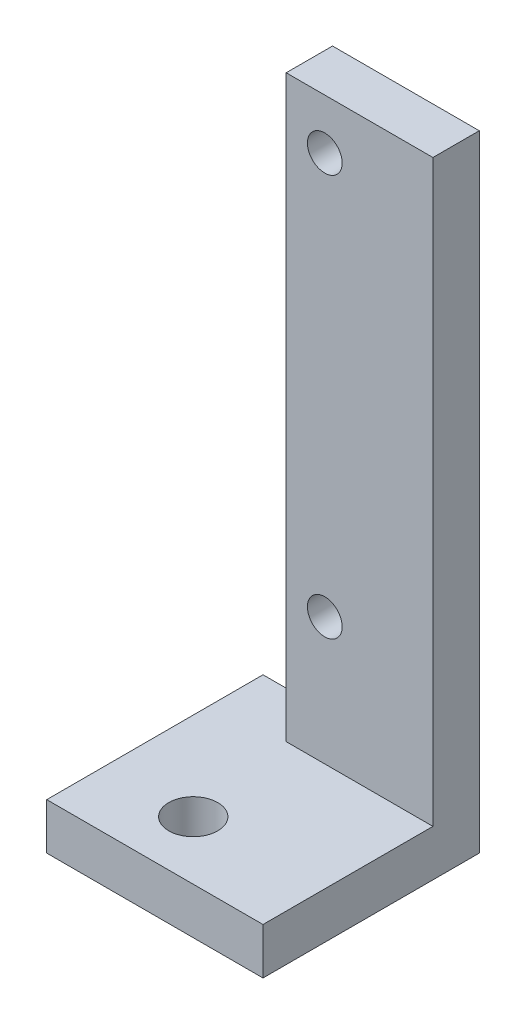
ISO-10303-21;
HEADER;
FILE_DESCRIPTION(('STEP AP214'),'2;1');
FILE_NAME('part.step','',(''),(''),'','','');
FILE_SCHEMA(('AUTOMOTIVE_DESIGN { 1 0 10303 214 1 1 1 1 }'));
ENDSEC;
DATA;
#1=APPLICATION_CONTEXT('core data for automotive mechanical design processes');
#2=APPLICATION_PROTOCOL_DEFINITION('international standard','automotive_design',2000,#1);
#3=PRODUCT_CONTEXT('',#1,'mechanical');
#4=PRODUCT('Part','Part','',(#3));
#5=PRODUCT_RELATED_PRODUCT_CATEGORY('part','',(#4));
#6=PRODUCT_DEFINITION_FORMATION('','',#4);
#7=PRODUCT_DEFINITION_CONTEXT('part definition',#1,'design');
#8=PRODUCT_DEFINITION('design','',#6,#7);
#9=PRODUCT_DEFINITION_SHAPE('','',#8);
#10=(LENGTH_UNIT() NAMED_UNIT(*) SI_UNIT(.MILLI.,.METRE.));
#11=(NAMED_UNIT(*) PLANE_ANGLE_UNIT() SI_UNIT($,.RADIAN.));
#12=(NAMED_UNIT(*) SI_UNIT($,.STERADIAN.) SOLID_ANGLE_UNIT());
#13=UNCERTAINTY_MEASURE_WITH_UNIT(LENGTH_MEASURE(1.E-05),#10,'distance_accuracy_value','');
#14=(GEOMETRIC_REPRESENTATION_CONTEXT(3) GLOBAL_UNCERTAINTY_ASSIGNED_CONTEXT((#13)) GLOBAL_UNIT_ASSIGNED_CONTEXT((#10,
#11,#12)) REPRESENTATION_CONTEXT('',''));
#15=CARTESIAN_POINT('',(0.,0.,0.));
#16=DIRECTION('',(0.,0.,1.));
#17=DIRECTION('',(1.,0.,0.));
#18=AXIS2_PLACEMENT_3D('',#15,#16,#17);
#19=CARTESIAN_POINT('',(0.,32.5,6.));
#20=DIRECTION('',(0.,1.,0.));
#21=DIRECTION('',(0.,0.,1.));
#22=AXIS2_PLACEMENT_3D('',#19,#20,#21);
#23=PLANE('',#22);
#24=DIRECTION('',(0.,0.,1.));
#25=VECTOR('',#24,1.);
#26=CARTESIAN_POINT('',(-14.,32.5,0.));
#27=LINE('',#26,#25);
#28=CARTESIAN_POINT('',(-14.,32.5,0.));
#29=VERTEX_POINT('',#28);
#30=CARTESIAN_POINT('',(-14.,32.5,6.));
#31=VERTEX_POINT('',#30);
#32=EDGE_CURVE('E116',#29,#31,#27,.T.);
#33=ORIENTED_EDGE('',*,*,#32,.F.);
#34=DIRECTION('',(1.,0.,0.));
#35=VECTOR('',#34,1.);
#36=CARTESIAN_POINT('',(0.,32.5,0.));
#37=LINE('',#36,#35);
#38=CARTESIAN_POINT('',(-33.,32.5,0.));
#39=VERTEX_POINT('',#38);
#40=EDGE_CURVE('E80',#39,#29,#37,.T.);
#41=ORIENTED_EDGE('',*,*,#40,.F.);
#42=DIRECTION('',(0.,0.,-1.));
#43=VECTOR('',#42,1.);
#44=CARTESIAN_POINT('',(-33.,32.5,6.));
#45=LINE('',#44,#43);
#46=CARTESIAN_POINT('',(-33.,32.5,6.));
#47=VERTEX_POINT('',#46);
#48=EDGE_CURVE('E145',#47,#39,#45,.T.);
#49=ORIENTED_EDGE('',*,*,#48,.F.);
#50=DIRECTION('',(1.,0.,0.));
#51=VECTOR('',#50,1.);
#52=CARTESIAN_POINT('',(0.,32.5,6.));
#53=LINE('',#52,#51);
#54=EDGE_CURVE('E124',#47,#31,#53,.T.);
#55=ORIENTED_EDGE('',*,*,#54,.T.);
#56=EDGE_LOOP('',(#33,#41,#49,#55));
#57=FACE_BOUND('',#56,.T.);
#58=ADVANCED_FACE('F47',(#57),#23,.T.);
#59=CARTESIAN_POINT('',(0.,0.,6.));
#60=DIRECTION('',(0.,0.,1.));
#61=DIRECTION('',(1.,0.,0.));
#62=AXIS2_PLACEMENT_3D('',#59,#60,#61);
#63=PLANE('',#62);
#64=DIRECTION('',(0.,-1.,0.));
#65=VECTOR('',#64,1.);
#66=CARTESIAN_POINT('',(-14.,0.,6.));
#67=LINE('',#66,#65);
#68=CARTESIAN_POINT('',(-14.,-42.5,6.));
#69=VERTEX_POINT('',#68);
#70=EDGE_CURVE('E62',#31,#69,#67,.T.);
#71=ORIENTED_EDGE('',*,*,#70,.F.);
#72=ORIENTED_EDGE('',*,*,#54,.F.);
#73=DIRECTION('',(0.,-1.,0.));
#74=VECTOR('',#73,1.);
#75=CARTESIAN_POINT('',(-33.,0.,6.));
#76=LINE('',#75,#74);
#77=CARTESIAN_POINT('',(-33.,-42.5,6.));
#78=VERTEX_POINT('',#77);
#79=EDGE_CURVE('E159',#47,#78,#76,.T.);
#80=ORIENTED_EDGE('',*,*,#79,.T.);
#81=DIRECTION('',(1.,0.,0.));
#82=VECTOR('',#81,1.);
#83=CARTESIAN_POINT('',(0.,-42.5,6.));
#84=LINE('',#83,#82);
#85=EDGE_CURVE('E55',#78,#69,#84,.T.);
#86=ORIENTED_EDGE('',*,*,#85,.T.);
#87=EDGE_LOOP('',(#71,#72,#80,#86));
#88=FACE_BOUND('',#87,.T.);
#89=CARTESIAN_POINT('',(-28.,26.,6.));
#90=DIRECTION('',(0.,0.,-1.));
#91=DIRECTION('',(-1.,0.,0.));
#92=AXIS2_PLACEMENT_3D('',#89,#90,#91);
#93=CIRCLE('',#92,2.25);
#94=CARTESIAN_POINT('',(-30.25,26.,6.));
#95=VERTEX_POINT('',#94);
#96=EDGE_CURVE('E170',#95,#95,#93,.T.);
#97=ORIENTED_EDGE('',*,*,#96,.T.);
#98=EDGE_LOOP('',(#97));
#99=FACE_BOUND('',#98,.T.);
#100=CARTESIAN_POINT('',(-28.,-26.,6.));
#101=DIRECTION('',(0.,0.,-1.));
#102=DIRECTION('',(-1.,0.,0.));
#103=AXIS2_PLACEMENT_3D('',#100,#101,#102);
#104=CIRCLE('',#103,2.25);
#105=CARTESIAN_POINT('',(-30.25,-26.,6.));
#106=VERTEX_POINT('',#105);
#107=EDGE_CURVE('E154',#106,#106,#104,.F.);
#108=ORIENTED_EDGE('',*,*,#107,.F.);
#109=EDGE_LOOP('',(#108));
#110=FACE_BOUND('',#109,.T.);
#111=ADVANCED_FACE('F223',(#88,#99,#110),#63,.T.);
#112=CARTESIAN_POINT('',(0.,0.,0.));
#113=DIRECTION('',(0.,0.,1.));
#114=DIRECTION('',(1.,0.,0.));
#115=AXIS2_PLACEMENT_3D('',#112,#113,#114);
#116=PLANE('',#115);
#117=ORIENTED_EDGE('',*,*,#40,.T.);
#118=DIRECTION('',(0.,-1.,0.));
#119=VECTOR('',#118,1.);
#120=CARTESIAN_POINT('',(-14.,32.5,0.));
#121=LINE('',#120,#119);
#122=CARTESIAN_POINT('',(-14.,-48.5,0.));
#123=VERTEX_POINT('',#122);
#124=EDGE_CURVE('E114',#29,#123,#121,.T.);
#125=ORIENTED_EDGE('',*,*,#124,.T.);
#126=DIRECTION('',(1.,0.,0.));
#127=VECTOR('',#126,1.);
#128=CARTESIAN_POINT('',(0.,-48.5,0.));
#129=LINE('',#128,#127);
#130=CARTESIAN_POINT('',(-42.,-48.5,0.));
#131=VERTEX_POINT('',#130);
#132=EDGE_CURVE('E137',#131,#123,#129,.T.);
#133=ORIENTED_EDGE('',*,*,#132,.F.);
#134=DIRECTION('',(0.,1.,0.));
#135=VECTOR('',#134,1.);
#136=CARTESIAN_POINT('',(-42.,-48.5,0.));
#137=LINE('',#136,#135);
#138=CARTESIAN_POINT('',(-42.,-42.5,0.));
#139=VERTEX_POINT('',#138);
#140=EDGE_CURVE('E166',#131,#139,#137,.T.);
#141=ORIENTED_EDGE('',*,*,#140,.T.);
#142=DIRECTION('',(-1.,0.,0.));
#143=VECTOR('',#142,1.);
#144=CARTESIAN_POINT('',(-28.,-42.5,0.));
#145=LINE('',#144,#143);
#146=CARTESIAN_POINT('',(-33.,-42.5,0.));
#147=VERTEX_POINT('',#146);
#148=EDGE_CURVE('E88',#147,#139,#145,.T.);
#149=ORIENTED_EDGE('',*,*,#148,.F.);
#150=DIRECTION('',(0.,-1.,0.));
#151=VECTOR('',#150,1.);
#152=CARTESIAN_POINT('',(-33.,0.,0.));
#153=LINE('',#152,#151);
#154=EDGE_CURVE('E130',#39,#147,#153,.T.);
#155=ORIENTED_EDGE('',*,*,#154,.F.);
#156=EDGE_LOOP('',(#117,#125,#133,#141,#149,#155));
#157=FACE_BOUND('',#156,.T.);
#158=CARTESIAN_POINT('',(-28.,26.,0.));
#159=DIRECTION('',(0.,0.,-1.));
#160=DIRECTION('',(-1.,0.,0.));
#161=AXIS2_PLACEMENT_3D('',#158,#159,#160);
#162=CIRCLE('',#161,2.25);
#163=CARTESIAN_POINT('',(-30.25,26.,0.));
#164=VERTEX_POINT('',#163);
#165=EDGE_CURVE('E160',#164,#164,#162,.T.);
#166=ORIENTED_EDGE('',*,*,#165,.F.);
#167=EDGE_LOOP('',(#166));
#168=FACE_BOUND('',#167,.T.);
#169=CARTESIAN_POINT('',(-28.,-26.,0.));
#170=DIRECTION('',(0.,0.,-1.));
#171=DIRECTION('',(-1.,0.,0.));
#172=AXIS2_PLACEMENT_3D('',#169,#170,#171);
#173=CIRCLE('',#172,2.25);
#174=CARTESIAN_POINT('',(-30.25,-26.,0.));
#175=VERTEX_POINT('',#174);
#176=EDGE_CURVE('E155',#175,#175,#173,.F.);
#177=ORIENTED_EDGE('',*,*,#176,.T.);
#178=EDGE_LOOP('',(#177));
#179=FACE_BOUND('',#178,.T.);
#180=ADVANCED_FACE('F127',(#157,#168,#179),#116,.F.);
#181=CARTESIAN_POINT('',(0.,-48.5,28.));
#182=DIRECTION('',(0.,0.,1.));
#183=DIRECTION('',(1.,0.,0.));
#184=AXIS2_PLACEMENT_3D('',#181,#182,#183);
#185=PLANE('',#184);
#186=DIRECTION('',(0.,-1.,0.));
#187=VECTOR('',#186,1.);
#188=CARTESIAN_POINT('',(-14.,32.5,28.));
#189=LINE('',#188,#187);
#190=CARTESIAN_POINT('',(-14.,-42.5,28.));
#191=VERTEX_POINT('',#190);
#192=CARTESIAN_POINT('',(-14.,-48.5,28.));
#193=VERTEX_POINT('',#192);
#194=EDGE_CURVE('E121',#191,#193,#189,.T.);
#195=ORIENTED_EDGE('',*,*,#194,.F.);
#196=DIRECTION('',(1.,0.,0.));
#197=VECTOR('',#196,1.);
#198=CARTESIAN_POINT('',(0.,-42.5,28.));
#199=LINE('',#198,#197);
#200=CARTESIAN_POINT('',(-42.,-42.5,28.));
#201=VERTEX_POINT('',#200);
#202=EDGE_CURVE('E142',#201,#191,#199,.T.);
#203=ORIENTED_EDGE('',*,*,#202,.F.);
#204=DIRECTION('',(0.,1.,0.));
#205=VECTOR('',#204,1.);
#206=CARTESIAN_POINT('',(-42.,-48.5,28.));
#207=LINE('',#206,#205);
#208=CARTESIAN_POINT('',(-42.,-48.5,28.));
#209=VERTEX_POINT('',#208);
#210=EDGE_CURVE('E178',#209,#201,#207,.T.);
#211=ORIENTED_EDGE('',*,*,#210,.F.);
#212=DIRECTION('',(1.,0.,0.));
#213=VECTOR('',#212,1.);
#214=CARTESIAN_POINT('',(0.,-48.5,28.));
#215=LINE('',#214,#213);
#216=EDGE_CURVE('E132',#209,#193,#215,.T.);
#217=ORIENTED_EDGE('',*,*,#216,.T.);
#218=EDGE_LOOP('',(#195,#203,#211,#217));
#219=FACE_BOUND('',#218,.T.);
#220=ADVANCED_FACE('F212',(#219),#185,.T.);
#221=CARTESIAN_POINT('',(0.,-48.5,0.));
#222=DIRECTION('',(0.,-1.,0.));
#223=DIRECTION('',(0.,0.,-1.));
#224=AXIS2_PLACEMENT_3D('',#221,#222,#223);
#225=PLANE('',#224);
#226=DIRECTION('',(0.,0.,-1.));
#227=VECTOR('',#226,1.);
#228=CARTESIAN_POINT('',(-14.,-48.5,0.));
#229=LINE('',#228,#227);
#230=EDGE_CURVE('E118',#193,#123,#229,.T.);
#231=ORIENTED_EDGE('',*,*,#230,.F.);
#232=ORIENTED_EDGE('',*,*,#216,.F.);
#233=DIRECTION('',(0.,0.,1.));
#234=VECTOR('',#233,1.);
#235=CARTESIAN_POINT('',(-42.,-48.5,0.));
#236=LINE('',#235,#234);
#237=EDGE_CURVE('E187',#131,#209,#236,.T.);
#238=ORIENTED_EDGE('',*,*,#237,.F.);
#239=ORIENTED_EDGE('',*,*,#132,.T.);
#240=EDGE_LOOP('',(#231,#232,#238,#239));
#241=FACE_BOUND('',#240,.T.);
#242=CARTESIAN_POINT('',(-30.6,-48.5,20.4299482445639));
#243=DIRECTION('',(0.,1.,0.));
#244=DIRECTION('',(0.,0.,-1.));
#245=AXIS2_PLACEMENT_3D('',#242,#243,#244);
#246=CIRCLE('',#245,3.175);
#247=CARTESIAN_POINT('',(-30.6,-48.5,17.2549482445639));
#248=VERTEX_POINT('',#247);
#249=EDGE_CURVE('E182',#248,#248,#246,.T.);
#250=ORIENTED_EDGE('',*,*,#249,.T.);
#251=EDGE_LOOP('',(#250));
#252=FACE_BOUND('',#251,.T.);
#253=ADVANCED_FACE('F208',(#241,#252),#225,.T.);
#254=CARTESIAN_POINT('',(0.,-42.5,0.));
#255=DIRECTION('',(0.,-1.,0.));
#256=DIRECTION('',(0.,0.,-1.));
#257=AXIS2_PLACEMENT_3D('',#254,#255,#256);
#258=PLANE('',#257);
#259=ORIENTED_EDGE('',*,*,#202,.T.);
#260=DIRECTION('',(0.,0.,-1.));
#261=VECTOR('',#260,1.);
#262=CARTESIAN_POINT('',(-14.,-42.5,0.));
#263=LINE('',#262,#261);
#264=EDGE_CURVE('E11',#191,#69,#263,.T.);
#265=ORIENTED_EDGE('',*,*,#264,.T.);
#266=ORIENTED_EDGE('',*,*,#85,.F.);
#267=DIRECTION('',(0.,0.,-1.));
#268=VECTOR('',#267,1.);
#269=CARTESIAN_POINT('',(-33.,-42.5,6.));
#270=LINE('',#269,#268);
#271=EDGE_CURVE('E151',#78,#147,#270,.T.);
#272=ORIENTED_EDGE('',*,*,#271,.T.);
#273=ORIENTED_EDGE('',*,*,#148,.T.);
#274=DIRECTION('',(0.,0.,1.));
#275=VECTOR('',#274,1.);
#276=CARTESIAN_POINT('',(-42.,-42.5,0.));
#277=LINE('',#276,#275);
#278=EDGE_CURVE('E188',#139,#201,#277,.T.);
#279=ORIENTED_EDGE('',*,*,#278,.T.);
#280=EDGE_LOOP('',(#259,#265,#266,#272,#273,#279));
#281=FACE_BOUND('',#280,.T.);
#282=CARTESIAN_POINT('',(-30.6,-42.5,20.4299482445639));
#283=DIRECTION('',(0.,1.,0.));
#284=DIRECTION('',(0.,0.,-1.));
#285=AXIS2_PLACEMENT_3D('',#282,#283,#284);
#286=CIRCLE('',#285,3.175);
#287=CARTESIAN_POINT('',(-30.6,-42.5,17.2549482445639));
#288=VERTEX_POINT('',#287);
#289=EDGE_CURVE('E183',#288,#288,#286,.T.);
#290=ORIENTED_EDGE('',*,*,#289,.F.);
#291=EDGE_LOOP('',(#290));
#292=FACE_BOUND('',#291,.T.);
#293=ADVANCED_FACE('F216',(#281,#292),#258,.F.);
#294=CARTESIAN_POINT('',(-33.,0.,6.));
#295=DIRECTION('',(-1.,0.,0.));
#296=DIRECTION('',(0.,1.,0.));
#297=AXIS2_PLACEMENT_3D('',#294,#295,#296);
#298=PLANE('',#297);
#299=ORIENTED_EDGE('',*,*,#154,.T.);
#300=ORIENTED_EDGE('',*,*,#271,.F.);
#301=ORIENTED_EDGE('',*,*,#79,.F.);
#302=ORIENTED_EDGE('',*,*,#48,.T.);
#303=EDGE_LOOP('',(#299,#300,#301,#302));
#304=FACE_BOUND('',#303,.T.);
#305=ADVANCED_FACE('F221',(#304),#298,.T.);
#306=CARTESIAN_POINT('',(-28.,26.,6.));
#307=DIRECTION('',(0.,0.,-1.));
#308=DIRECTION('',(1.,0.,0.));
#309=AXIS2_PLACEMENT_3D('',#306,#307,#308);
#310=CYLINDRICAL_SURFACE('',#309,2.25);
#311=ORIENTED_EDGE('',*,*,#96,.F.);
#312=EDGE_LOOP('',(#311));
#313=FACE_BOUND('',#312,.T.);
#314=ORIENTED_EDGE('',*,*,#165,.T.);
#315=EDGE_LOOP('',(#314));
#316=FACE_BOUND('',#315,.T.);
#317=ADVANCED_FACE('F234',(#313,#316),#310,.F.);
#318=CARTESIAN_POINT('',(-28.,-26.,6.));
#319=DIRECTION('',(0.,0.,-1.));
#320=DIRECTION('',(1.,0.,0.));
#321=AXIS2_PLACEMENT_3D('',#318,#319,#320);
#322=CYLINDRICAL_SURFACE('',#321,2.25);
#323=ORIENTED_EDGE('',*,*,#107,.T.);
#324=EDGE_LOOP('',(#323));
#325=FACE_BOUND('',#324,.T.);
#326=ORIENTED_EDGE('',*,*,#176,.F.);
#327=EDGE_LOOP('',(#326));
#328=FACE_BOUND('',#327,.T.);
#329=ADVANCED_FACE('F231',(#325,#328),#322,.F.);
#330=CARTESIAN_POINT('',(-42.,-48.5,0.));
#331=DIRECTION('',(1.,0.,0.));
#332=DIRECTION('',(0.,0.,1.));
#333=AXIS2_PLACEMENT_3D('',#330,#331,#332);
#334=PLANE('',#333);
#335=ORIENTED_EDGE('',*,*,#278,.F.);
#336=ORIENTED_EDGE('',*,*,#140,.F.);
#337=ORIENTED_EDGE('',*,*,#237,.T.);
#338=ORIENTED_EDGE('',*,*,#210,.T.);
#339=EDGE_LOOP('',(#335,#336,#337,#338));
#340=FACE_BOUND('',#339,.T.);
#341=ADVANCED_FACE('F215',(#340),#334,.F.);
#342=CARTESIAN_POINT('',(-30.6,-48.5,20.4299482445639));
#343=DIRECTION('',(0.,1.,0.));
#344=DIRECTION('',(0.,0.,1.));
#345=AXIS2_PLACEMENT_3D('',#342,#343,#344);
#346=CYLINDRICAL_SURFACE('',#345,3.175);
#347=ORIENTED_EDGE('',*,*,#249,.F.);
#348=EDGE_LOOP('',(#347));
#349=FACE_BOUND('',#348,.T.);
#350=ORIENTED_EDGE('',*,*,#289,.T.);
#351=EDGE_LOOP('',(#350));
#352=FACE_BOUND('',#351,.T.);
#353=ADVANCED_FACE('F251',(#349,#352),#346,.F.);
#354=CARTESIAN_POINT('',(-14.,32.5,0.));
#355=DIRECTION('',(-1.,0.,0.));
#356=DIRECTION('',(0.,0.,1.));
#357=AXIS2_PLACEMENT_3D('',#354,#355,#356);
#358=PLANE('',#357);
#359=ORIENTED_EDGE('',*,*,#230,.T.);
#360=ORIENTED_EDGE('',*,*,#124,.F.);
#361=ORIENTED_EDGE('',*,*,#32,.T.);
#362=ORIENTED_EDGE('',*,*,#70,.T.);
#363=ORIENTED_EDGE('',*,*,#264,.F.);
#364=ORIENTED_EDGE('',*,*,#194,.T.);
#365=EDGE_LOOP('',(#359,#360,#361,#362,#363,#364));
#366=FACE_BOUND('',#365,.T.);
#367=ADVANCED_FACE('F115',(#366),#358,.F.);
#368=CLOSED_SHELL('',(#58,#111,#180,#220,#253,#293,#305,#317,#329,#341,#353,#367));
#369=MANIFOLD_SOLID_BREP('B2',#368);
#370=ADVANCED_BREP_SHAPE_REPRESENTATION('',(#18,#369),#14);
#371=SHAPE_DEFINITION_REPRESENTATION(#9,#370);
ENDSEC;
END-ISO-10303-21;
